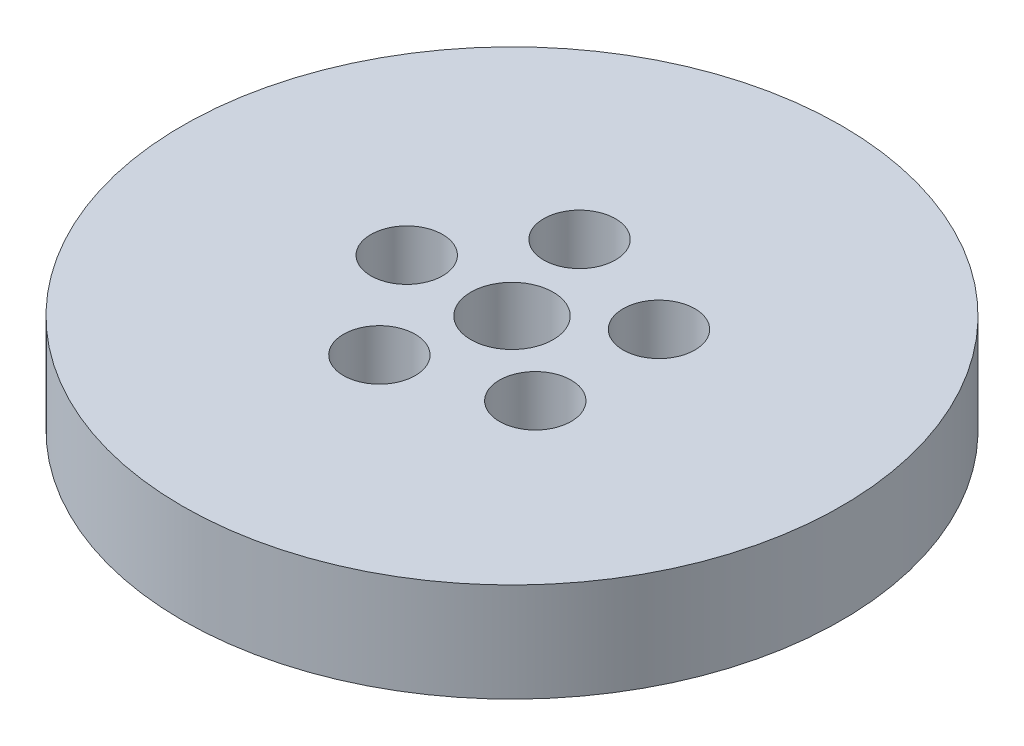
ISO-10303-21;
HEADER;
FILE_DESCRIPTION(('STEP AP214'),'2;1');
FILE_NAME('part.step','',(''),(''),'','','');
FILE_SCHEMA(('AUTOMOTIVE_DESIGN { 1 0 10303 214 1 1 1 1 }'));
ENDSEC;
DATA;
#1=APPLICATION_CONTEXT('core data for automotive mechanical design processes');
#2=APPLICATION_PROTOCOL_DEFINITION('international standard','automotive_design',2000,#1);
#3=PRODUCT_CONTEXT('',#1,'mechanical');
#4=PRODUCT('Part','Part','',(#3));
#5=PRODUCT_RELATED_PRODUCT_CATEGORY('part','',(#4));
#6=PRODUCT_DEFINITION_FORMATION('','',#4);
#7=PRODUCT_DEFINITION_CONTEXT('part definition',#1,'design');
#8=PRODUCT_DEFINITION('design','',#6,#7);
#9=PRODUCT_DEFINITION_SHAPE('','',#8);
#10=(LENGTH_UNIT() NAMED_UNIT(*) SI_UNIT(.MILLI.,.METRE.));
#11=(NAMED_UNIT(*) PLANE_ANGLE_UNIT() SI_UNIT($,.RADIAN.));
#12=(NAMED_UNIT(*) SI_UNIT($,.STERADIAN.) SOLID_ANGLE_UNIT());
#13=UNCERTAINTY_MEASURE_WITH_UNIT(LENGTH_MEASURE(1.E-05),#10,'distance_accuracy_value','');
#14=(GEOMETRIC_REPRESENTATION_CONTEXT(3) GLOBAL_UNCERTAINTY_ASSIGNED_CONTEXT((#13)) GLOBAL_UNIT_ASSIGNED_CONTEXT((#10,
#11,#12)) REPRESENTATION_CONTEXT('',''));
#15=CARTESIAN_POINT('',(0.,0.,0.));
#16=DIRECTION('',(0.,0.,1.));
#17=DIRECTION('',(1.,0.,0.));
#18=AXIS2_PLACEMENT_3D('',#15,#16,#17);
#19=CARTESIAN_POINT('',(0.,12.,0.));
#20=DIRECTION('',(0.,-1.,0.));
#21=DIRECTION('',(0.,0.,-1.));
#22=AXIS2_PLACEMENT_3D('',#19,#20,#21);
#23=CYLINDRICAL_SURFACE('',#22,40.);
#24=CARTESIAN_POINT('',(0.,12.,0.));
#25=DIRECTION('',(0.,1.,0.));
#26=DIRECTION('',(0.,0.,1.));
#27=AXIS2_PLACEMENT_3D('',#24,#25,#26);
#28=CIRCLE('',#27,40.);
#29=CARTESIAN_POINT('',(0.,12.,40.));
#30=VERTEX_POINT('',#29);
#31=EDGE_CURVE('E10',#30,#30,#28,.T.);
#32=ORIENTED_EDGE('',*,*,#31,.F.);
#33=EDGE_LOOP('',(#32));
#34=FACE_BOUND('',#33,.T.);
#35=CARTESIAN_POINT('',(0.,0.,0.));
#36=DIRECTION('',(0.,1.,0.));
#37=DIRECTION('',(0.,0.,1.));
#38=AXIS2_PLACEMENT_3D('',#35,#36,#37);
#39=CIRCLE('',#38,40.);
#40=CARTESIAN_POINT('',(0.,0.,40.));
#41=VERTEX_POINT('',#40);
#42=EDGE_CURVE('E37',#41,#41,#39,.T.);
#43=ORIENTED_EDGE('',*,*,#42,.T.);
#44=EDGE_LOOP('',(#43));
#45=FACE_BOUND('',#44,.T.);
#46=ADVANCED_FACE('F40',(#34,#45),#23,.T.);
#47=CARTESIAN_POINT('',(0.,12.,0.));
#48=DIRECTION('',(0.,1.,0.));
#49=DIRECTION('',(0.,0.,1.));
#50=AXIS2_PLACEMENT_3D('',#47,#48,#49);
#51=PLANE('',#50);
#52=CARTESIAN_POINT('',(-3.94735026118333,12.,-12.1486949143079));
#53=DIRECTION('',(0.,1.,0.));
#54=DIRECTION('',(-0.95105651629515,0.,0.309016994374958));
#55=AXIS2_PLACEMENT_3D('',#52,#53,#54);
#56=CIRCLE('',#55,4.35295606985114);
#57=CARTESIAN_POINT('',(-8.08725749656178,12.,-10.8035575129563));
#58=VERTEX_POINT('',#57);
#59=EDGE_CURVE('E70',#58,#58,#56,.T.);
#60=ORIENTED_EDGE('',*,*,#59,.F.);
#61=EDGE_LOOP('',(#60));
#62=FACE_BOUND('',#61,.T.);
#63=CARTESIAN_POINT('',(10.3342971492783,12.,-7.5083063759954));
#64=DIRECTION('',(0.,1.,0.));
#65=DIRECTION('',(-0.58778525229248,0.,-0.809016994374942));
#66=AXIS2_PLACEMENT_3D('',#63,#64,#65);
#67=CIRCLE('',#66,4.35295606985114);
#68=CARTESIAN_POINT('',(7.77569376754278,12.,-11.0299218122725));
#69=VERTEX_POINT('',#68);
#70=EDGE_CURVE('E71',#69,#69,#67,.T.);
#71=ORIENTED_EDGE('',*,*,#70,.F.);
#72=EDGE_LOOP('',(#71));
#73=FACE_BOUND('',#72,.T.);
#74=CARTESIAN_POINT('',(10.3342971492784,12.,7.50830637599525));
#75=DIRECTION('',(0.,1.,0.));
#76=DIRECTION('',(0.587785252292469,0.,-0.809016994374951));
#77=AXIS2_PLACEMENT_3D('',#74,#75,#76);
#78=CIRCLE('',#77,4.35295606985114);
#79=CARTESIAN_POINT('',(12.8929005310139,12.,3.98669093971809));
#80=VERTEX_POINT('',#79);
#81=EDGE_CURVE('E78',#80,#80,#78,.T.);
#82=ORIENTED_EDGE('',*,*,#81,.F.);
#83=EDGE_LOOP('',(#82));
#84=FACE_BOUND('',#83,.T.);
#85=CARTESIAN_POINT('',(-3.94735026118316,12.,12.148694914308));
#86=DIRECTION('',(0.,1.,0.));
#87=DIRECTION('',(0.951056516295155,0.,0.309016994374945));
#88=AXIS2_PLACEMENT_3D('',#85,#86,#87);
#89=CIRCLE('',#88,4.35295606985114);
#90=CARTESIAN_POINT('',(0.192556974195307,12.,13.4938323156595));
#91=VERTEX_POINT('',#90);
#92=EDGE_CURVE('E61',#91,#91,#89,.T.);
#93=ORIENTED_EDGE('',*,*,#92,.F.);
#94=EDGE_LOOP('',(#93));
#95=FACE_BOUND('',#94,.T.);
#96=CARTESIAN_POINT('',(-12.7738937761904,12.,0.));
#97=DIRECTION('',(0.,1.,0.));
#98=DIRECTION('',(0.,0.,1.));
#99=AXIS2_PLACEMENT_3D('',#96,#97,#98);
#100=CIRCLE('',#99,4.35295606985114);
#101=CARTESIAN_POINT('',(-12.7738937761904,12.,4.35295606985114));
#102=VERTEX_POINT('',#101);
#103=EDGE_CURVE('E54',#102,#102,#100,.T.);
#104=ORIENTED_EDGE('',*,*,#103,.F.);
#105=EDGE_LOOP('',(#104));
#106=FACE_BOUND('',#105,.T.);
#107=CARTESIAN_POINT('',(0.,12.,0.));
#108=DIRECTION('',(0.,1.,0.));
#109=DIRECTION('',(0.,0.,1.));
#110=AXIS2_PLACEMENT_3D('',#107,#108,#109);
#111=CIRCLE('',#110,5.);
#112=CARTESIAN_POINT('',(0.,12.,5.));
#113=VERTEX_POINT('',#112);
#114=EDGE_CURVE('E50',#113,#113,#111,.T.);
#115=ORIENTED_EDGE('',*,*,#114,.F.);
#116=EDGE_LOOP('',(#115));
#117=FACE_BOUND('',#116,.T.);
#118=ORIENTED_EDGE('',*,*,#31,.T.);
#119=EDGE_LOOP('',(#118));
#120=FACE_BOUND('',#119,.T.);
#121=ADVANCED_FACE('F94',(#62,#73,#84,#95,#106,#117,#120),#51,.T.);
#122=CARTESIAN_POINT('',(0.,0.,0.));
#123=DIRECTION('',(0.,1.,0.));
#124=DIRECTION('',(0.,0.,1.));
#125=AXIS2_PLACEMENT_3D('',#122,#123,#124);
#126=PLANE('',#125);
#127=CARTESIAN_POINT('',(0.,0.,0.));
#128=DIRECTION('',(0.,1.,0.));
#129=DIRECTION('',(0.,0.,1.));
#130=AXIS2_PLACEMENT_3D('',#127,#128,#129);
#131=CIRCLE('',#130,5.);
#132=CARTESIAN_POINT('',(0.,0.,5.));
#133=VERTEX_POINT('',#132);
#134=EDGE_CURVE('E47',#133,#133,#131,.T.);
#135=ORIENTED_EDGE('',*,*,#134,.T.);
#136=EDGE_LOOP('',(#135));
#137=FACE_BOUND('',#136,.T.);
#138=ORIENTED_EDGE('',*,*,#42,.F.);
#139=EDGE_LOOP('',(#138));
#140=FACE_BOUND('',#139,.T.);
#141=ADVANCED_FACE('F100',(#137,#140),#126,.F.);
#142=CARTESIAN_POINT('',(0.,12.,0.));
#143=DIRECTION('',(0.,-1.,0.));
#144=DIRECTION('',(0.,0.,-1.));
#145=AXIS2_PLACEMENT_3D('',#142,#143,#144);
#146=CYLINDRICAL_SURFACE('',#145,5.);
#147=ORIENTED_EDGE('',*,*,#114,.T.);
#148=EDGE_LOOP('',(#147));
#149=FACE_BOUND('',#148,.T.);
#150=ORIENTED_EDGE('',*,*,#134,.F.);
#151=EDGE_LOOP('',(#150));
#152=FACE_BOUND('',#151,.T.);
#153=ADVANCED_FACE('F106',(#149,#152),#146,.F.);
#154=CARTESIAN_POINT('',(-12.7738937761904,2.29030559249303,0.));
#155=DIRECTION('',(0.,1.,0.));
#156=DIRECTION('',(0.,0.,1.));
#157=AXIS2_PLACEMENT_3D('',#154,#155,#156);
#158=CYLINDRICAL_SURFACE('',#157,4.35295606985114);
#159=CARTESIAN_POINT('',(-12.7738937761904,2.29030559249303,0.));
#160=DIRECTION('',(0.,1.,0.));
#161=DIRECTION('',(0.,0.,1.));
#162=AXIS2_PLACEMENT_3D('',#159,#160,#161);
#163=CIRCLE('',#162,4.35295606985114);
#164=CARTESIAN_POINT('',(-12.7738937761904,2.29030559249303,4.35295606985114));
#165=VERTEX_POINT('',#164);
#166=EDGE_CURVE('E55',#165,#165,#163,.T.);
#167=ORIENTED_EDGE('',*,*,#166,.F.);
#168=EDGE_LOOP('',(#167));
#169=FACE_BOUND('',#168,.T.);
#170=ORIENTED_EDGE('',*,*,#103,.T.);
#171=EDGE_LOOP('',(#170));
#172=FACE_BOUND('',#171,.T.);
#173=ADVANCED_FACE('F108',(#169,#172),#158,.F.);
#174=CARTESIAN_POINT('',(-12.7738937761904,2.29030559249303,0.));
#175=DIRECTION('',(0.,1.,0.));
#176=DIRECTION('',(0.,0.,1.));
#177=AXIS2_PLACEMENT_3D('',#174,#175,#176);
#178=PLANE('',#177);
#179=ORIENTED_EDGE('',*,*,#166,.T.);
#180=EDGE_LOOP('',(#179));
#181=FACE_BOUND('',#180,.T.);
#182=ADVANCED_FACE('F138',(#181),#178,.T.);
#183=CARTESIAN_POINT('',(-3.94735026118316,2.29030559249303,12.148694914308));
#184=DIRECTION('',(0.,1.,0.));
#185=DIRECTION('',(0.,0.,1.));
#186=AXIS2_PLACEMENT_3D('',#183,#184,#185);
#187=CYLINDRICAL_SURFACE('',#186,4.35295606985114);
#188=CARTESIAN_POINT('',(-3.94735026118316,2.29030559249303,12.148694914308));
#189=DIRECTION('',(0.,1.,0.));
#190=DIRECTION('',(0.951056516295155,0.,0.309016994374945));
#191=AXIS2_PLACEMENT_3D('',#188,#189,#190);
#192=CIRCLE('',#191,4.35295606985114);
#193=CARTESIAN_POINT('',(0.192556974195307,2.29030559249303,13.4938323156595));
#194=VERTEX_POINT('',#193);
#195=EDGE_CURVE('E59',#194,#194,#192,.T.);
#196=ORIENTED_EDGE('',*,*,#195,.F.);
#197=EDGE_LOOP('',(#196));
#198=FACE_BOUND('',#197,.T.);
#199=ORIENTED_EDGE('',*,*,#92,.T.);
#200=EDGE_LOOP('',(#199));
#201=FACE_BOUND('',#200,.T.);
#202=ADVANCED_FACE('F150',(#198,#201),#187,.F.);
#203=CARTESIAN_POINT('',(-3.94735026118316,2.29030559249303,12.148694914308));
#204=DIRECTION('',(0.,1.,0.));
#205=DIRECTION('',(0.951056516295155,0.,0.309016994374945));
#206=AXIS2_PLACEMENT_3D('',#203,#204,#205);
#207=PLANE('',#206);
#208=ORIENTED_EDGE('',*,*,#195,.T.);
#209=EDGE_LOOP('',(#208));
#210=FACE_BOUND('',#209,.T.);
#211=ADVANCED_FACE('F89',(#210),#207,.T.);
#212=CARTESIAN_POINT('',(10.3342971492784,2.29030559249303,7.50830637599525));
#213=DIRECTION('',(0.,1.,0.));
#214=DIRECTION('',(0.,0.,1.));
#215=AXIS2_PLACEMENT_3D('',#212,#213,#214);
#216=CYLINDRICAL_SURFACE('',#215,4.35295606985114);
#217=CARTESIAN_POINT('',(10.3342971492784,2.29030559249303,7.50830637599525));
#218=DIRECTION('',(0.,1.,0.));
#219=DIRECTION('',(0.587785252292469,0.,-0.809016994374951));
#220=AXIS2_PLACEMENT_3D('',#217,#218,#219);
#221=CIRCLE('',#220,4.35295606985114);
#222=CARTESIAN_POINT('',(12.8929005310139,2.29030559249303,3.98669093971809));
#223=VERTEX_POINT('',#222);
#224=EDGE_CURVE('E63',#223,#223,#221,.T.);
#225=ORIENTED_EDGE('',*,*,#224,.F.);
#226=EDGE_LOOP('',(#225));
#227=FACE_BOUND('',#226,.T.);
#228=ORIENTED_EDGE('',*,*,#81,.T.);
#229=EDGE_LOOP('',(#228));
#230=FACE_BOUND('',#229,.T.);
#231=ADVANCED_FACE('F87',(#227,#230),#216,.F.);
#232=CARTESIAN_POINT('',(10.3342971492784,2.29030559249303,7.50830637599525));
#233=DIRECTION('',(0.,1.,0.));
#234=DIRECTION('',(0.587785252292469,0.,-0.809016994374951));
#235=AXIS2_PLACEMENT_3D('',#232,#233,#234);
#236=PLANE('',#235);
#237=ORIENTED_EDGE('',*,*,#224,.T.);
#238=EDGE_LOOP('',(#237));
#239=FACE_BOUND('',#238,.T.);
#240=ADVANCED_FACE('F84',(#239),#236,.T.);
#241=CARTESIAN_POINT('',(10.3342971492783,2.29030559249303,-7.5083063759954));
#242=DIRECTION('',(0.,1.,0.));
#243=DIRECTION('',(0.,0.,1.));
#244=AXIS2_PLACEMENT_3D('',#241,#242,#243);
#245=CYLINDRICAL_SURFACE('',#244,4.35295606985114);
#246=CARTESIAN_POINT('',(10.3342971492783,2.29030559249303,-7.5083063759954));
#247=DIRECTION('',(0.,1.,0.));
#248=DIRECTION('',(-0.58778525229248,0.,-0.809016994374942));
#249=AXIS2_PLACEMENT_3D('',#246,#247,#248);
#250=CIRCLE('',#249,4.35295606985114);
#251=CARTESIAN_POINT('',(7.77569376754278,2.29030559249303,-11.0299218122725));
#252=VERTEX_POINT('',#251);
#253=EDGE_CURVE('E76',#252,#252,#250,.T.);
#254=ORIENTED_EDGE('',*,*,#253,.F.);
#255=EDGE_LOOP('',(#254));
#256=FACE_BOUND('',#255,.T.);
#257=ORIENTED_EDGE('',*,*,#70,.T.);
#258=EDGE_LOOP('',(#257));
#259=FACE_BOUND('',#258,.T.);
#260=ADVANCED_FACE('F185',(#256,#259),#245,.F.);
#261=CARTESIAN_POINT('',(10.3342971492783,2.29030559249303,-7.5083063759954));
#262=DIRECTION('',(0.,1.,0.));
#263=DIRECTION('',(-0.58778525229248,0.,-0.809016994374942));
#264=AXIS2_PLACEMENT_3D('',#261,#262,#263);
#265=PLANE('',#264);
#266=ORIENTED_EDGE('',*,*,#253,.T.);
#267=EDGE_LOOP('',(#266));
#268=FACE_BOUND('',#267,.T.);
#269=ADVANCED_FACE('F189',(#268),#265,.T.);
#270=CARTESIAN_POINT('',(-3.94735026118333,2.29030559249303,-12.1486949143079));
#271=DIRECTION('',(0.,1.,0.));
#272=DIRECTION('',(0.,0.,1.));
#273=AXIS2_PLACEMENT_3D('',#270,#271,#272);
#274=CYLINDRICAL_SURFACE('',#273,4.35295606985114);
#275=CARTESIAN_POINT('',(-3.94735026118333,2.29030559249303,-12.1486949143079));
#276=DIRECTION('',(0.,1.,0.));
#277=DIRECTION('',(-0.95105651629515,0.,0.309016994374958));
#278=AXIS2_PLACEMENT_3D('',#275,#276,#277);
#279=CIRCLE('',#278,4.35295606985114);
#280=CARTESIAN_POINT('',(-8.08725749656178,2.29030559249303,-10.8035575129563));
#281=VERTEX_POINT('',#280);
#282=EDGE_CURVE('E69',#281,#281,#279,.T.);
#283=ORIENTED_EDGE('',*,*,#282,.F.);
#284=EDGE_LOOP('',(#283));
#285=FACE_BOUND('',#284,.T.);
#286=ORIENTED_EDGE('',*,*,#59,.T.);
#287=EDGE_LOOP('',(#286));
#288=FACE_BOUND('',#287,.T.);
#289=ADVANCED_FACE('F200',(#285,#288),#274,.F.);
#290=CARTESIAN_POINT('',(-3.94735026118333,2.29030559249303,-12.1486949143079));
#291=DIRECTION('',(0.,1.,0.));
#292=DIRECTION('',(-0.95105651629515,0.,0.309016994374958));
#293=AXIS2_PLACEMENT_3D('',#290,#291,#292);
#294=PLANE('',#293);
#295=ORIENTED_EDGE('',*,*,#282,.T.);
#296=EDGE_LOOP('',(#295));
#297=FACE_BOUND('',#296,.T.);
#298=ADVANCED_FACE('F208',(#297),#294,.T.);
#299=CLOSED_SHELL('',(#46,#121,#141,#153,#173,#182,#202,#211,#231,#240,#260,#269,#289,#298));
#300=MANIFOLD_SOLID_BREP('B2',#299);
#301=ADVANCED_BREP_SHAPE_REPRESENTATION('',(#18,#300),#14);
#302=SHAPE_DEFINITION_REPRESENTATION(#9,#301);
ENDSEC;
END-ISO-10303-21;
